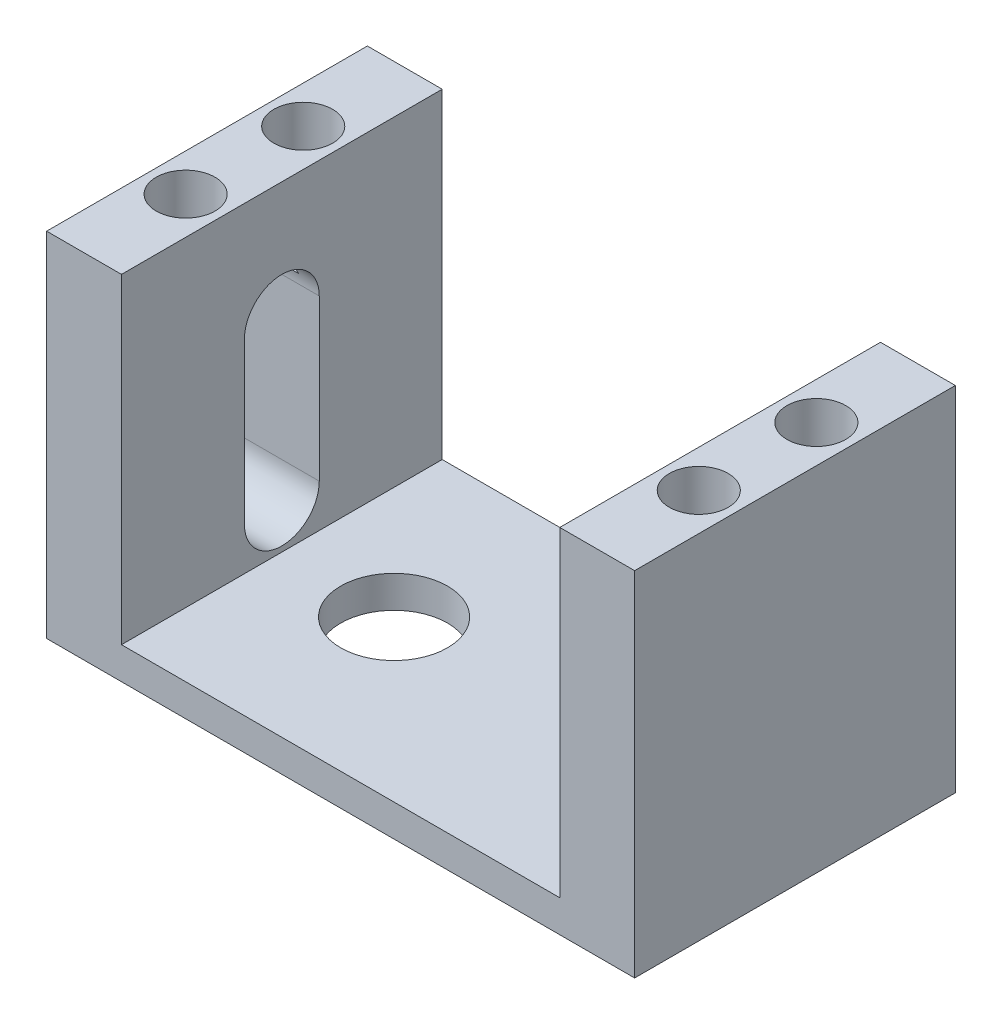
ISO-10303-21;
HEADER;
FILE_DESCRIPTION(('STEP AP214'),'2;1');
FILE_NAME('part.step','',(''),(''),'','','');
FILE_SCHEMA(('AUTOMOTIVE_DESIGN { 1 0 10303 214 1 1 1 1 }'));
ENDSEC;
DATA;
#1=APPLICATION_CONTEXT('core data for automotive mechanical design processes');
#2=APPLICATION_PROTOCOL_DEFINITION('international standard','automotive_design',2000,#1);
#3=PRODUCT_CONTEXT('',#1,'mechanical');
#4=PRODUCT('Part','Part','',(#3));
#5=PRODUCT_RELATED_PRODUCT_CATEGORY('part','',(#4));
#6=PRODUCT_DEFINITION_FORMATION('','',#4);
#7=PRODUCT_DEFINITION_CONTEXT('part definition',#1,'design');
#8=PRODUCT_DEFINITION('design','',#6,#7);
#9=PRODUCT_DEFINITION_SHAPE('','',#8);
#10=(LENGTH_UNIT() NAMED_UNIT(*) SI_UNIT(.MILLI.,.METRE.));
#11=(NAMED_UNIT(*) PLANE_ANGLE_UNIT() SI_UNIT($,.RADIAN.));
#12=(NAMED_UNIT(*) SI_UNIT($,.STERADIAN.) SOLID_ANGLE_UNIT());
#13=UNCERTAINTY_MEASURE_WITH_UNIT(LENGTH_MEASURE(1.E-05),#10,'distance_accuracy_value','');
#14=(GEOMETRIC_REPRESENTATION_CONTEXT(3) GLOBAL_UNCERTAINTY_ASSIGNED_CONTEXT((#13)) GLOBAL_UNIT_ASSIGNED_CONTEXT((#10,
#11,#12)) REPRESENTATION_CONTEXT('',''));
#15=CARTESIAN_POINT('',(0.,0.,0.));
#16=DIRECTION('',(0.,0.,1.));
#17=DIRECTION('',(1.,0.,0.));
#18=AXIS2_PLACEMENT_3D('',#15,#16,#17);
#19=CARTESIAN_POINT('',(0.,3.,0.));
#20=DIRECTION('',(0.,1.,0.));
#21=DIRECTION('',(0.,0.,1.));
#22=AXIS2_PLACEMENT_3D('',#19,#20,#21);
#23=PLANE('',#22);
#24=CARTESIAN_POINT('',(-10.,3.,0.));
#25=DIRECTION('',(0.,1.,0.));
#26=DIRECTION('',(0.,0.,1.));
#27=AXIS2_PLACEMENT_3D('',#24,#25,#26);
#28=CIRCLE('',#27,5.);
#29=CARTESIAN_POINT('',(-10.,3.,5.));
#30=VERTEX_POINT('',#29);
#31=EDGE_CURVE('E505',#30,#30,#28,.F.);
#32=ORIENTED_EDGE('',*,*,#31,.T.);
#33=EDGE_LOOP('',(#32));
#34=FACE_BOUND('',#33,.T.);
#35=DIRECTION('',(-1.,0.,0.));
#36=VECTOR('',#35,1.);
#37=CARTESIAN_POINT('',(-27.5,3.,-15.));
#38=LINE('',#37,#36);
#39=CARTESIAN_POINT('',(20.5,3.,-15.));
#40=VERTEX_POINT('',#39);
#41=CARTESIAN_POINT('',(-20.5,3.,-15.));
#42=VERTEX_POINT('',#41);
#43=EDGE_CURVE('E231',#40,#42,#38,.T.);
#44=ORIENTED_EDGE('',*,*,#43,.T.);
#45=DIRECTION('',(0.,0.,-1.));
#46=VECTOR('',#45,1.);
#47=CARTESIAN_POINT('',(-20.5,3.,-15.));
#48=LINE('',#47,#46);
#49=CARTESIAN_POINT('',(-20.5,3.,15.));
#50=VERTEX_POINT('',#49);
#51=EDGE_CURVE('E193',#50,#42,#48,.T.);
#52=ORIENTED_EDGE('',*,*,#51,.F.);
#53=DIRECTION('',(1.,0.,0.));
#54=VECTOR('',#53,1.);
#55=CARTESIAN_POINT('',(-27.5,3.,15.));
#56=LINE('',#55,#54);
#57=CARTESIAN_POINT('',(20.5,3.,15.));
#58=VERTEX_POINT('',#57);
#59=EDGE_CURVE('E39',#50,#58,#56,.T.);
#60=ORIENTED_EDGE('',*,*,#59,.T.);
#61=DIRECTION('',(0.,0.,1.));
#62=VECTOR('',#61,1.);
#63=CARTESIAN_POINT('',(20.5,3.,-15.));
#64=LINE('',#63,#62);
#65=EDGE_CURVE('E212',#40,#58,#64,.T.);
#66=ORIENTED_EDGE('',*,*,#65,.F.);
#67=EDGE_LOOP('',(#44,#52,#60,#66));
#68=FACE_BOUND('',#67,.T.);
#69=ADVANCED_FACE('F35',(#34,#68),#23,.T.);
#70=CARTESIAN_POINT('',(27.5,3.,-15.));
#71=DIRECTION('',(-1.,0.,0.));
#72=DIRECTION('',(0.,0.,1.));
#73=AXIS2_PLACEMENT_3D('',#70,#71,#72);
#74=PLANE('',#73);
#75=DIRECTION('',(0.,0.,-1.));
#76=VECTOR('',#75,1.);
#77=CARTESIAN_POINT('',(27.5,0.,-15.));
#78=LINE('',#77,#76);
#79=CARTESIAN_POINT('',(27.5,0.,15.));
#80=VERTEX_POINT('',#79);
#81=CARTESIAN_POINT('',(27.5,0.,-15.));
#82=VERTEX_POINT('',#81);
#83=EDGE_CURVE('E238',#80,#82,#78,.T.);
#84=ORIENTED_EDGE('',*,*,#83,.T.);
#85=DIRECTION('',(0.,-1.,0.));
#86=VECTOR('',#85,1.);
#87=CARTESIAN_POINT('',(27.5,3.,-15.));
#88=LINE('',#87,#86);
#89=CARTESIAN_POINT('',(27.5,33.,-15.));
#90=VERTEX_POINT('',#89);
#91=EDGE_CURVE('E11',#90,#82,#88,.T.);
#92=ORIENTED_EDGE('',*,*,#91,.F.);
#93=DIRECTION('',(0.,0.,-1.));
#94=VECTOR('',#93,1.);
#95=CARTESIAN_POINT('',(27.5,33.,15.));
#96=LINE('',#95,#94);
#97=CARTESIAN_POINT('',(27.5,33.,15.));
#98=VERTEX_POINT('',#97);
#99=EDGE_CURVE('E213',#98,#90,#96,.T.);
#100=ORIENTED_EDGE('',*,*,#99,.F.);
#101=DIRECTION('',(0.,-1.,0.));
#102=VECTOR('',#101,1.);
#103=CARTESIAN_POINT('',(27.5,3.,15.));
#104=LINE('',#103,#102);
#105=EDGE_CURVE('E256',#98,#80,#104,.T.);
#106=ORIENTED_EDGE('',*,*,#105,.T.);
#107=EDGE_LOOP('',(#84,#92,#100,#106));
#108=FACE_BOUND('',#107,.T.);
#109=ADVANCED_FACE('F37',(#108),#74,.F.);
#110=CARTESIAN_POINT('',(-27.5,3.,-15.));
#111=DIRECTION('',(0.,0.,1.));
#112=DIRECTION('',(1.,0.,0.));
#113=AXIS2_PLACEMENT_3D('',#110,#111,#112);
#114=PLANE('',#113);
#115=DIRECTION('',(-1.,0.,0.));
#116=VECTOR('',#115,1.);
#117=CARTESIAN_POINT('',(-27.5,0.,-15.));
#118=LINE('',#117,#116);
#119=CARTESIAN_POINT('',(-27.5,0.,-15.));
#120=VERTEX_POINT('',#119);
#121=EDGE_CURVE('E244',#82,#120,#118,.T.);
#122=ORIENTED_EDGE('',*,*,#121,.T.);
#123=DIRECTION('',(0.,-1.,0.));
#124=VECTOR('',#123,1.);
#125=CARTESIAN_POINT('',(-27.5,3.,-15.));
#126=LINE('',#125,#124);
#127=CARTESIAN_POINT('',(-27.5,33.,-15.));
#128=VERTEX_POINT('',#127);
#129=EDGE_CURVE('E45',#128,#120,#126,.T.);
#130=ORIENTED_EDGE('',*,*,#129,.F.);
#131=DIRECTION('',(-1.,0.,0.));
#132=VECTOR('',#131,1.);
#133=CARTESIAN_POINT('',(-20.5,33.,-15.));
#134=LINE('',#133,#132);
#135=CARTESIAN_POINT('',(-20.5,33.,-15.));
#136=VERTEX_POINT('',#135);
#137=EDGE_CURVE('E196',#136,#128,#134,.T.);
#138=ORIENTED_EDGE('',*,*,#137,.F.);
#139=DIRECTION('',(0.,-1.,0.));
#140=VECTOR('',#139,1.);
#141=CARTESIAN_POINT('',(-20.5,33.,-15.));
#142=LINE('',#141,#140);
#143=EDGE_CURVE('E206',#136,#42,#142,.T.);
#144=ORIENTED_EDGE('',*,*,#143,.T.);
#145=ORIENTED_EDGE('',*,*,#43,.F.);
#146=DIRECTION('',(0.,-1.,0.));
#147=VECTOR('',#146,1.);
#148=CARTESIAN_POINT('',(20.5,33.,-15.));
#149=LINE('',#148,#147);
#150=CARTESIAN_POINT('',(20.5,33.,-15.));
#151=VERTEX_POINT('',#150);
#152=EDGE_CURVE('E234',#151,#40,#149,.T.);
#153=ORIENTED_EDGE('',*,*,#152,.F.);
#154=DIRECTION('',(-1.,0.,0.));
#155=VECTOR('',#154,1.);
#156=CARTESIAN_POINT('',(27.5,33.,-15.));
#157=LINE('',#156,#155);
#158=EDGE_CURVE('E216',#90,#151,#157,.T.);
#159=ORIENTED_EDGE('',*,*,#158,.F.);
#160=ORIENTED_EDGE('',*,*,#91,.T.);
#161=EDGE_LOOP('',(#122,#130,#138,#144,#145,#153,#159,#160));
#162=FACE_BOUND('',#161,.T.);
#163=ADVANCED_FACE('F287',(#162),#114,.F.);
#164=CARTESIAN_POINT('',(-27.5,3.,-15.));
#165=DIRECTION('',(1.,0.,0.));
#166=DIRECTION('',(0.,0.,-1.));
#167=AXIS2_PLACEMENT_3D('',#164,#165,#166);
#168=PLANE('',#167);
#169=CARTESIAN_POINT('',(-27.5,7.,0.));
#170=DIRECTION('',(-1.,0.,0.));
#171=DIRECTION('',(0.,0.,1.));
#172=AXIS2_PLACEMENT_3D('',#169,#170,#171);
#173=CIRCLE('',#172,3.5);
#174=CARTESIAN_POINT('',(-27.5,7.,-3.49999999999999));
#175=VERTEX_POINT('',#174);
#176=CARTESIAN_POINT('',(-27.5,7.,3.5));
#177=VERTEX_POINT('',#176);
#178=EDGE_CURVE('E519',#175,#177,#173,.T.);
#179=ORIENTED_EDGE('',*,*,#178,.F.);
#180=DIRECTION('',(0.,-1.,0.));
#181=VECTOR('',#180,1.);
#182=CARTESIAN_POINT('',(-27.5,22.,-3.5));
#183=LINE('',#182,#181);
#184=CARTESIAN_POINT('',(-27.5,22.,-3.5));
#185=VERTEX_POINT('',#184);
#186=EDGE_CURVE('E522',#185,#175,#183,.T.);
#187=ORIENTED_EDGE('',*,*,#186,.F.);
#188=CARTESIAN_POINT('',(-27.5,22.,0.));
#189=DIRECTION('',(-1.,0.,0.));
#190=DIRECTION('',(0.,0.,1.));
#191=AXIS2_PLACEMENT_3D('',#188,#189,#190);
#192=CIRCLE('',#191,3.5);
#193=CARTESIAN_POINT('',(-27.5,22.,3.5));
#194=VERTEX_POINT('',#193);
#195=EDGE_CURVE('E160',#194,#185,#192,.T.);
#196=ORIENTED_EDGE('',*,*,#195,.F.);
#197=DIRECTION('',(0.,1.,0.));
#198=VECTOR('',#197,1.);
#199=CARTESIAN_POINT('',(-27.5,22.,3.5));
#200=LINE('',#199,#198);
#201=EDGE_CURVE('E53',#177,#194,#200,.T.);
#202=ORIENTED_EDGE('',*,*,#201,.F.);
#203=EDGE_LOOP('',(#179,#187,#196,#202));
#204=FACE_BOUND('',#203,.T.);
#205=DIRECTION('',(0.,0.,1.));
#206=VECTOR('',#205,1.);
#207=CARTESIAN_POINT('',(-27.5,0.,-15.));
#208=LINE('',#207,#206);
#209=CARTESIAN_POINT('',(-27.5,0.,15.));
#210=VERTEX_POINT('',#209);
#211=EDGE_CURVE('E249',#120,#210,#208,.T.);
#212=ORIENTED_EDGE('',*,*,#211,.T.);
#213=DIRECTION('',(0.,-1.,0.));
#214=VECTOR('',#213,1.);
#215=CARTESIAN_POINT('',(-27.5,3.,15.));
#216=LINE('',#215,#214);
#217=CARTESIAN_POINT('',(-27.5,33.,15.));
#218=VERTEX_POINT('',#217);
#219=EDGE_CURVE('E258',#218,#210,#216,.T.);
#220=ORIENTED_EDGE('',*,*,#219,.F.);
#221=DIRECTION('',(0.,0.,1.));
#222=VECTOR('',#221,1.);
#223=CARTESIAN_POINT('',(-27.5,33.,-15.));
#224=LINE('',#223,#222);
#225=EDGE_CURVE('E199',#128,#218,#224,.T.);
#226=ORIENTED_EDGE('',*,*,#225,.F.);
#227=ORIENTED_EDGE('',*,*,#129,.T.);
#228=EDGE_LOOP('',(#212,#220,#226,#227));
#229=FACE_BOUND('',#228,.T.);
#230=ADVANCED_FACE('F265',(#204,#229),#168,.F.);
#231=CARTESIAN_POINT('',(-27.5,3.,15.));
#232=DIRECTION('',(0.,0.,-1.));
#233=DIRECTION('',(-1.,0.,0.));
#234=AXIS2_PLACEMENT_3D('',#231,#232,#233);
#235=PLANE('',#234);
#236=DIRECTION('',(1.,0.,0.));
#237=VECTOR('',#236,1.);
#238=CARTESIAN_POINT('',(-27.5,0.,15.));
#239=LINE('',#238,#237);
#240=EDGE_CURVE('E254',#210,#80,#239,.T.);
#241=ORIENTED_EDGE('',*,*,#240,.T.);
#242=ORIENTED_EDGE('',*,*,#105,.F.);
#243=DIRECTION('',(1.,0.,0.));
#244=VECTOR('',#243,1.);
#245=CARTESIAN_POINT('',(20.5,33.,15.));
#246=LINE('',#245,#244);
#247=CARTESIAN_POINT('',(20.5,33.,15.));
#248=VERTEX_POINT('',#247);
#249=EDGE_CURVE('E220',#248,#98,#246,.T.);
#250=ORIENTED_EDGE('',*,*,#249,.F.);
#251=DIRECTION('',(0.,-1.,0.));
#252=VECTOR('',#251,1.);
#253=CARTESIAN_POINT('',(20.5,33.,15.));
#254=LINE('',#253,#252);
#255=EDGE_CURVE('E223',#248,#58,#254,.T.);
#256=ORIENTED_EDGE('',*,*,#255,.T.);
#257=ORIENTED_EDGE('',*,*,#59,.F.);
#258=DIRECTION('',(0.,-1.,0.));
#259=VECTOR('',#258,1.);
#260=CARTESIAN_POINT('',(-20.5,33.,15.));
#261=LINE('',#260,#259);
#262=CARTESIAN_POINT('',(-20.5,33.,15.));
#263=VERTEX_POINT('',#262);
#264=EDGE_CURVE('E210',#263,#50,#261,.T.);
#265=ORIENTED_EDGE('',*,*,#264,.F.);
#266=DIRECTION('',(1.,0.,0.));
#267=VECTOR('',#266,1.);
#268=CARTESIAN_POINT('',(-27.5,33.,15.));
#269=LINE('',#268,#267);
#270=EDGE_CURVE('E202',#218,#263,#269,.T.);
#271=ORIENTED_EDGE('',*,*,#270,.F.);
#272=ORIENTED_EDGE('',*,*,#219,.T.);
#273=EDGE_LOOP('',(#241,#242,#250,#256,#257,#265,#271,#272));
#274=FACE_BOUND('',#273,.T.);
#275=ADVANCED_FACE('F272',(#274),#235,.F.);
#276=CARTESIAN_POINT('',(0.,0.,0.));
#277=DIRECTION('',(0.,1.,0.));
#278=DIRECTION('',(0.,0.,1.));
#279=AXIS2_PLACEMENT_3D('',#276,#277,#278);
#280=PLANE('',#279);
#281=CARTESIAN_POINT('',(-10.,0.,0.));
#282=DIRECTION('',(0.,-1.,0.));
#283=DIRECTION('',(0.,0.,-1.));
#284=AXIS2_PLACEMENT_3D('',#281,#282,#283);
#285=CIRCLE('',#284,5.);
#286=CARTESIAN_POINT('',(-10.,0.,-5.));
#287=VERTEX_POINT('',#286);
#288=EDGE_CURVE('E517',#287,#287,#285,.T.);
#289=ORIENTED_EDGE('',*,*,#288,.F.);
#290=EDGE_LOOP('',(#289));
#291=FACE_BOUND('',#290,.T.);
#292=ORIENTED_EDGE('',*,*,#83,.F.);
#293=ORIENTED_EDGE('',*,*,#240,.F.);
#294=ORIENTED_EDGE('',*,*,#211,.F.);
#295=ORIENTED_EDGE('',*,*,#121,.F.);
#296=EDGE_LOOP('',(#292,#293,#294,#295));
#297=FACE_BOUND('',#296,.T.);
#298=ADVANCED_FACE('F270',(#291,#297),#280,.F.);
#299=CARTESIAN_POINT('',(20.5,33.,-15.));
#300=DIRECTION('',(1.,0.,0.));
#301=DIRECTION('',(0.,0.,-1.));
#302=AXIS2_PLACEMENT_3D('',#299,#300,#301);
#303=PLANE('',#302);
#304=ORIENTED_EDGE('',*,*,#65,.T.);
#305=ORIENTED_EDGE('',*,*,#255,.F.);
#306=DIRECTION('',(0.,0.,1.));
#307=VECTOR('',#306,1.);
#308=CARTESIAN_POINT('',(20.5,33.,-15.));
#309=LINE('',#308,#307);
#310=EDGE_CURVE('E218',#151,#248,#309,.T.);
#311=ORIENTED_EDGE('',*,*,#310,.F.);
#312=ORIENTED_EDGE('',*,*,#152,.T.);
#313=EDGE_LOOP('',(#304,#305,#311,#312));
#314=FACE_BOUND('',#313,.T.);
#315=ADVANCED_FACE('F282',(#314),#303,.F.);
#316=CARTESIAN_POINT('',(0.,33.,0.));
#317=DIRECTION('',(0.,1.,0.));
#318=DIRECTION('',(0.,0.,1.));
#319=AXIS2_PLACEMENT_3D('',#316,#317,#318);
#320=PLANE('',#319);
#321=CARTESIAN_POINT('',(24.,33.,-5.50000000000001));
#322=DIRECTION('',(0.,1.,0.));
#323=DIRECTION('',(0.,0.,-1.));
#324=AXIS2_PLACEMENT_3D('',#321,#322,#323);
#325=CIRCLE('',#324,2.75);
#326=CARTESIAN_POINT('',(24.,33.,-8.25));
#327=VERTEX_POINT('',#326);
#328=EDGE_CURVE('E174',#327,#327,#325,.T.);
#329=ORIENTED_EDGE('',*,*,#328,.F.);
#330=EDGE_LOOP('',(#329));
#331=FACE_BOUND('',#330,.T.);
#332=CARTESIAN_POINT('',(24.,33.,5.49999999999999));
#333=DIRECTION('',(0.,1.,0.));
#334=DIRECTION('',(0.,0.,-1.));
#335=AXIS2_PLACEMENT_3D('',#332,#333,#334);
#336=CIRCLE('',#335,2.75);
#337=CARTESIAN_POINT('',(24.,33.,2.75));
#338=VERTEX_POINT('',#337);
#339=EDGE_CURVE('E173',#338,#338,#336,.T.);
#340=ORIENTED_EDGE('',*,*,#339,.F.);
#341=EDGE_LOOP('',(#340));
#342=FACE_BOUND('',#341,.T.);
#343=ORIENTED_EDGE('',*,*,#99,.T.);
#344=ORIENTED_EDGE('',*,*,#158,.T.);
#345=ORIENTED_EDGE('',*,*,#310,.T.);
#346=ORIENTED_EDGE('',*,*,#249,.T.);
#347=EDGE_LOOP('',(#343,#344,#345,#346));
#348=FACE_BOUND('',#347,.T.);
#349=ADVANCED_FACE('F278',(#331,#342,#348),#320,.T.);
#350=CARTESIAN_POINT('',(-20.5,33.,-15.));
#351=DIRECTION('',(-1.,0.,0.));
#352=DIRECTION('',(0.,0.,1.));
#353=AXIS2_PLACEMENT_3D('',#350,#351,#352);
#354=PLANE('',#353);
#355=CARTESIAN_POINT('',(-20.5,22.,0.));
#356=DIRECTION('',(-1.,0.,0.));
#357=DIRECTION('',(0.,0.,1.));
#358=AXIS2_PLACEMENT_3D('',#355,#356,#357);
#359=CIRCLE('',#358,3.5);
#360=CARTESIAN_POINT('',(-20.5,22.,-3.5));
#361=VERTEX_POINT('',#360);
#362=CARTESIAN_POINT('',(-20.5,22.,3.5));
#363=VERTEX_POINT('',#362);
#364=EDGE_CURVE('E150',#361,#363,#359,.F.);
#365=ORIENTED_EDGE('',*,*,#364,.F.);
#366=DIRECTION('',(0.,1.,0.));
#367=VECTOR('',#366,1.);
#368=CARTESIAN_POINT('',(-20.5,22.,-3.5));
#369=LINE('',#368,#367);
#370=CARTESIAN_POINT('',(-20.5,7.,-3.5));
#371=VERTEX_POINT('',#370);
#372=EDGE_CURVE('E61',#371,#361,#369,.T.);
#373=ORIENTED_EDGE('',*,*,#372,.F.);
#374=CARTESIAN_POINT('',(-20.5,7.,0.));
#375=DIRECTION('',(-1.,0.,0.));
#376=DIRECTION('',(0.,0.,1.));
#377=AXIS2_PLACEMENT_3D('',#374,#375,#376);
#378=CIRCLE('',#377,3.5);
#379=CARTESIAN_POINT('',(-20.5,7.,3.5));
#380=VERTEX_POINT('',#379);
#381=EDGE_CURVE('E158',#380,#371,#378,.F.);
#382=ORIENTED_EDGE('',*,*,#381,.F.);
#383=DIRECTION('',(0.,-1.,0.));
#384=VECTOR('',#383,1.);
#385=CARTESIAN_POINT('',(-20.5,22.,3.5));
#386=LINE('',#385,#384);
#387=EDGE_CURVE('E141',#363,#380,#386,.T.);
#388=ORIENTED_EDGE('',*,*,#387,.F.);
#389=EDGE_LOOP('',(#365,#373,#382,#388));
#390=FACE_BOUND('',#389,.T.);
#391=ORIENTED_EDGE('',*,*,#51,.T.);
#392=ORIENTED_EDGE('',*,*,#143,.F.);
#393=DIRECTION('',(0.,0.,-1.));
#394=VECTOR('',#393,1.);
#395=CARTESIAN_POINT('',(-20.5,33.,-15.));
#396=LINE('',#395,#394);
#397=EDGE_CURVE('E204',#263,#136,#396,.T.);
#398=ORIENTED_EDGE('',*,*,#397,.F.);
#399=ORIENTED_EDGE('',*,*,#264,.T.);
#400=EDGE_LOOP('',(#391,#392,#398,#399));
#401=FACE_BOUND('',#400,.T.);
#402=ADVANCED_FACE('F155',(#390,#401),#354,.F.);
#403=CARTESIAN_POINT('',(0.,33.,0.));
#404=DIRECTION('',(0.,1.,0.));
#405=DIRECTION('',(0.,0.,1.));
#406=AXIS2_PLACEMENT_3D('',#403,#404,#405);
#407=PLANE('',#406);
#408=CARTESIAN_POINT('',(-24.,33.,5.5));
#409=DIRECTION('',(0.,1.,0.));
#410=DIRECTION('',(0.,0.,1.));
#411=AXIS2_PLACEMENT_3D('',#408,#409,#410);
#412=CIRCLE('',#411,2.75);
#413=CARTESIAN_POINT('',(-24.,33.,8.25));
#414=VERTEX_POINT('',#413);
#415=EDGE_CURVE('E181',#414,#414,#412,.T.);
#416=ORIENTED_EDGE('',*,*,#415,.F.);
#417=EDGE_LOOP('',(#416));
#418=FACE_BOUND('',#417,.T.);
#419=CARTESIAN_POINT('',(-24.,33.,-5.5));
#420=DIRECTION('',(0.,1.,0.));
#421=DIRECTION('',(0.,0.,1.));
#422=AXIS2_PLACEMENT_3D('',#419,#420,#421);
#423=CIRCLE('',#422,2.75);
#424=CARTESIAN_POINT('',(-24.,33.,-2.75));
#425=VERTEX_POINT('',#424);
#426=EDGE_CURVE('E187',#425,#425,#423,.T.);
#427=ORIENTED_EDGE('',*,*,#426,.F.);
#428=EDGE_LOOP('',(#427));
#429=FACE_BOUND('',#428,.T.);
#430=ORIENTED_EDGE('',*,*,#137,.T.);
#431=ORIENTED_EDGE('',*,*,#225,.T.);
#432=ORIENTED_EDGE('',*,*,#270,.T.);
#433=ORIENTED_EDGE('',*,*,#397,.T.);
#434=EDGE_LOOP('',(#430,#431,#432,#433));
#435=FACE_BOUND('',#434,.T.);
#436=ADVANCED_FACE('F291',(#418,#429,#435),#407,.T.);
#437=CARTESIAN_POINT('',(-24.,23.,-5.5));
#438=DIRECTION('',(0.,1.,0.));
#439=DIRECTION('',(0.,0.,1.));
#440=AXIS2_PLACEMENT_3D('',#437,#438,#439);
#441=CYLINDRICAL_SURFACE('',#440,2.75);
#442=CARTESIAN_POINT('',(-24.,23.,-5.5));
#443=DIRECTION('',(0.,1.,0.));
#444=DIRECTION('',(0.,0.,1.));
#445=AXIS2_PLACEMENT_3D('',#442,#443,#444);
#446=CIRCLE('',#445,2.75);
#447=CARTESIAN_POINT('',(-22.2802262855984,23.,-3.35410196624968));
#448=VERTEX_POINT('',#447);
#449=CARTESIAN_POINT('',(-25.7197737144016,23.,-3.35410196624968));
#450=VERTEX_POINT('',#449);
#451=EDGE_CURVE('E190',#448,#450,#446,.T.);
#452=ORIENTED_EDGE('',*,*,#451,.F.);
#453=CARTESIAN_POINT('',(-25.7197737144016,23.,-3.35410196624968));
#454=CARTESIAN_POINT('',(-25.7017861807159,23.0483574767552,-3.33969373809158));
#455=CARTESIAN_POINT('',(-25.6822245740191,23.0958691014806,-3.32438083990102));
#456=CARTESIAN_POINT('',(-25.6398312595873,23.1889123552969,-3.29224773358903));
#457=CARTESIAN_POINT('',(-25.6169978415567,23.2344429324917,-3.27542673886246));
#458=CARTESIAN_POINT('',(-25.5678832246716,23.3233189700396,-3.24054242047114));
#459=CARTESIAN_POINT('',(-25.5415917792581,23.3666573844756,-3.22247548373751));
#460=CARTESIAN_POINT('',(-25.4855709586734,23.4506617787203,-3.18554392409529));
#461=CARTESIAN_POINT('',(-25.4558422027834,23.4913282378563,-3.16667944526275));
#462=CARTESIAN_POINT('',(-25.3611781441435,23.6091802549706,-3.10936503681371));
#463=CARTESIAN_POINT('',(-25.2909184533913,23.6819355386968,-3.07030877152763));
#464=CARTESIAN_POINT('',(-25.1372463719622,23.8131349378167,-2.99471243380997));
#465=CARTESIAN_POINT('',(-25.0538612974771,23.8716081457033,-2.95816735717018));
#466=CARTESIAN_POINT('',(-24.8807300584572,23.9703098488629,-2.89330044966885));
#467=CARTESIAN_POINT('',(-24.7915815109424,24.0113615026891,-2.86463810710713));
#468=CARTESIAN_POINT('',(-24.6057479137799,24.0791563703275,-2.81582521463158));
#469=CARTESIAN_POINT('',(-24.5090588174147,24.1058918398203,-2.79567927289054));
#470=CARTESIAN_POINT('',(-24.3165144694626,24.1438954340408,-2.76663227596203));
#471=CARTESIAN_POINT('',(-24.2208859795145,24.1559073629013,-2.75719245560625));
#472=CARTESIAN_POINT('',(-24.0284449671781,24.1670279986156,-2.74846189800399));
#473=CARTESIAN_POINT('',(-23.9316328029459,24.1661405165345,-2.74916816314757));
#474=CARTESIAN_POINT('',(-23.7404015703283,24.1515264052347,-2.76061880331371));
#475=CARTESIAN_POINT('',(-23.6459692943872,24.1379066356358,-2.7712796307602));
#476=CARTESIAN_POINT('',(-23.4613486367304,24.0979500640918,-2.80164761093278));
#477=CARTESIAN_POINT('',(-23.3711601214001,24.0716136628234,-2.82135447863446));
#478=CARTESIAN_POINT('',(-23.1974090033171,24.0062725873437,-2.86818361368007));
#479=CARTESIAN_POINT('',(-23.1138556639971,23.9672505765021,-2.89531602097428));
#480=CARTESIAN_POINT('',(-22.9556468970495,23.8770012374922,-2.95461799544054));
#481=CARTESIAN_POINT('',(-22.8809896243856,23.8257764468024,-2.98678651491383));
#482=CARTESIAN_POINT('',(-22.7405600215805,23.7108743867671,-3.05408281716615));
#483=CARTESIAN_POINT('',(-22.6750064837338,23.6469588189365,-3.08925846230325));
#484=CARTESIAN_POINT('',(-22.5553300106214,23.5088542779038,-3.15900879231877));
#485=CARTESIAN_POINT('',(-22.5012152727112,23.4346579998775,-3.19358303003867));
#486=CARTESIAN_POINT('',(-22.4183931898711,23.3005910325465,-3.24994172279825));
#487=CARTESIAN_POINT('',(-22.3868608990537,23.2427678040302,-3.27253711406551));
#488=CARTESIAN_POINT('',(-22.3294267923658,23.1237655345345,-3.31529407416746));
#489=CARTESIAN_POINT('',(-22.3035085037758,23.0625969896418,-3.33546268412089));
#490=CARTESIAN_POINT('',(-22.2802262855984,23.,-3.35410196624968));
#491=B_SPLINE_CURVE_WITH_KNOTS('',3,(#453,#454,#455,#456,#457,#458,#459,#460,#461,#462,#463,
#464,#465,#466,#467,#468,#469,#470,#471,#472,#473,#474,#475,#476,#477,#478,#479,#480,#481,#482,
#483,#484,#485,#486,#487,#488,#489,#490),.UNSPECIFIED.,.F.,.F.,(4,2,2,2,2,2,2,2,2,2,2,2,2,2,2,2,
2,2,4),(0.,0.160680386209557,0.32144507445736,0.48269733705506,0.643920592860245,
0.967379157361524,1.29017323867257,1.59530694510956,1.90060554686315,2.18974422827673,
2.47879748687786,2.76544635122677,3.05208618440682,3.3391194088426,3.62609299884227,
3.91907594980752,4.212268153809,4.42082430446127,4.62875995699674),.UNSPECIFIED.);
#492=EDGE_CURVE('E177',#450,#448,#491,.T.);
#493=ORIENTED_EDGE('',*,*,#492,.F.);
#494=EDGE_LOOP('',(#452,#493));
#495=FACE_BOUND('',#494,.T.);
#496=ORIENTED_EDGE('',*,*,#426,.T.);
#497=EDGE_LOOP('',(#496));
#498=FACE_BOUND('',#497,.T.);
#499=ADVANCED_FACE('F293',(#495,#498),#441,.F.);
#500=CARTESIAN_POINT('',(-24.,23.,-5.5));
#501=DIRECTION('',(0.,1.,0.));
#502=DIRECTION('',(0.,0.,1.));
#503=AXIS2_PLACEMENT_3D('',#500,#501,#502);
#504=PLANE('',#503);
#505=DIRECTION('',(-1.,0.,0.));
#506=VECTOR('',#505,1.);
#507=CARTESIAN_POINT('',(27.501,23.,-3.35410196624969));
#508=LINE('',#507,#506);
#509=EDGE_CURVE('E146',#450,#448,#508,.F.);
#510=ORIENTED_EDGE('',*,*,#509,.T.);
#511=ORIENTED_EDGE('',*,*,#451,.T.);
#512=EDGE_LOOP('',(#510,#511));
#513=FACE_BOUND('',#512,.T.);
#514=ADVANCED_FACE('F300',(#513),#504,.T.);
#515=CARTESIAN_POINT('',(-24.,23.,5.5));
#516=DIRECTION('',(0.,1.,0.));
#517=DIRECTION('',(0.,0.,1.));
#518=AXIS2_PLACEMENT_3D('',#515,#516,#517);
#519=CYLINDRICAL_SURFACE('',#518,2.75);
#520=CARTESIAN_POINT('',(-24.,23.,5.5));
#521=DIRECTION('',(0.,1.,0.));
#522=DIRECTION('',(0.,0.,1.));
#523=AXIS2_PLACEMENT_3D('',#520,#521,#522);
#524=CIRCLE('',#523,2.75);
#525=CARTESIAN_POINT('',(-25.7197737144016,23.,3.35410196624969));
#526=VERTEX_POINT('',#525);
#527=CARTESIAN_POINT('',(-22.2802262855984,23.,3.35410196624969));
#528=VERTEX_POINT('',#527);
#529=EDGE_CURVE('E184',#526,#528,#524,.T.);
#530=ORIENTED_EDGE('',*,*,#529,.F.);
#531=CARTESIAN_POINT('',(-22.2802262855984,23.,3.35410196624969));
#532=CARTESIAN_POINT('',(-22.2982138192841,23.0483574767552,3.33969373809159));
#533=CARTESIAN_POINT('',(-22.3177754259809,23.0958691014806,3.32438083990103));
#534=CARTESIAN_POINT('',(-22.3601687404127,23.1889123552969,3.29224773358903));
#535=CARTESIAN_POINT('',(-22.3830021584433,23.2344429324917,3.27542673886247));
#536=CARTESIAN_POINT('',(-22.4321167753284,23.3233189700396,3.24054242047114));
#537=CARTESIAN_POINT('',(-22.4584082207419,23.3666573844756,3.22247548373751));
#538=CARTESIAN_POINT('',(-22.5144290413266,23.4506617787203,3.18554392409529));
#539=CARTESIAN_POINT('',(-22.5441577972166,23.4913282378563,3.16667944526275));
#540=CARTESIAN_POINT('',(-22.6388218558565,23.6091802549706,3.10936503681371));
#541=CARTESIAN_POINT('',(-22.7090815466087,23.6819355386968,3.07030877152763));
#542=CARTESIAN_POINT('',(-22.8627536280378,23.8131349378167,2.99471243380997));
#543=CARTESIAN_POINT('',(-22.9461387025229,23.8716081457033,2.95816735717018));
#544=CARTESIAN_POINT('',(-23.1192699415428,23.970309848863,2.89330044966885));
#545=CARTESIAN_POINT('',(-23.2084184890576,24.0113615026891,2.86463810710713));
#546=CARTESIAN_POINT('',(-23.3942520862201,24.0791563703275,2.81582521463158));
#547=CARTESIAN_POINT('',(-23.4909411825853,24.1058918398203,2.79567927289054));
#548=CARTESIAN_POINT('',(-23.6834855305374,24.1438954340408,2.76663227596203));
#549=CARTESIAN_POINT('',(-23.7791140204855,24.1559073629013,2.75719245560625));
#550=CARTESIAN_POINT('',(-23.9715550328219,24.1670279986156,2.74846189800399));
#551=CARTESIAN_POINT('',(-24.0683671970541,24.1661405165345,2.74916816314757));
#552=CARTESIAN_POINT('',(-24.2595984296717,24.1515264052347,2.76061880331371));
#553=CARTESIAN_POINT('',(-24.3540307056128,24.1379066356358,2.7712796307602));
#554=CARTESIAN_POINT('',(-24.5386513632696,24.0979500640918,2.80164761093278));
#555=CARTESIAN_POINT('',(-24.6288398785999,24.0716136628235,2.82135447863446));
#556=CARTESIAN_POINT('',(-24.8025909966829,24.0062725873437,2.86818361368007));
#557=CARTESIAN_POINT('',(-24.8861443360029,23.9672505765021,2.89531602097428));
#558=CARTESIAN_POINT('',(-25.0443531029505,23.8770012374922,2.95461799544054));
#559=CARTESIAN_POINT('',(-25.1190103756144,23.8257764468024,2.98678651491383));
#560=CARTESIAN_POINT('',(-25.2594399784195,23.7108743867671,3.05408281716616));
#561=CARTESIAN_POINT('',(-25.3249935162662,23.6469588189365,3.08925846230326));
#562=CARTESIAN_POINT('',(-25.4446699893786,23.5088542779038,3.15900879231878));
#563=CARTESIAN_POINT('',(-25.4987847272888,23.4346579998775,3.19358303003867));
#564=CARTESIAN_POINT('',(-25.5816068101289,23.3005910325465,3.24994172279825));
#565=CARTESIAN_POINT('',(-25.6131391009463,23.2427678040302,3.27253711406551));
#566=CARTESIAN_POINT('',(-25.6705732076342,23.1237655345345,3.31529407416746));
#567=CARTESIAN_POINT('',(-25.6964914962242,23.0625969896418,3.33546268412089));
#568=CARTESIAN_POINT('',(-25.7197737144016,23.,3.35410196624969));
#569=B_SPLINE_CURVE_WITH_KNOTS('',3,(#531,#532,#533,#534,#535,#536,#537,#538,#539,#540,#541,
#542,#543,#544,#545,#546,#547,#548,#549,#550,#551,#552,#553,#554,#555,#556,#557,#558,#559,#560,
#561,#562,#563,#564,#565,#566,#567,#568),.UNSPECIFIED.,.F.,.F.,(4,2,2,2,2,2,2,2,2,2,2,2,2,2,2,2,
2,2,4),(0.,0.160680386209557,0.321445074457359,0.482697337055061,0.643920592860249,
0.967379157361533,1.29017323867258,1.59530694510956,1.90060554686316,2.18974422827674,
2.47879748687787,2.76544635122678,3.05208618440683,3.33911940884261,3.62609299884228,
3.91907594980754,4.21226815380901,4.42082430446129,4.62875995699675),.UNSPECIFIED.);
#570=EDGE_CURVE('E168',#528,#526,#569,.T.);
#571=ORIENTED_EDGE('',*,*,#570,.F.);
#572=EDGE_LOOP('',(#530,#571));
#573=FACE_BOUND('',#572,.T.);
#574=ORIENTED_EDGE('',*,*,#415,.T.);
#575=EDGE_LOOP('',(#574));
#576=FACE_BOUND('',#575,.T.);
#577=ADVANCED_FACE('F374',(#573,#576),#519,.F.);
#578=CARTESIAN_POINT('',(-24.,23.,5.5));
#579=DIRECTION('',(0.,1.,0.));
#580=DIRECTION('',(0.,0.,1.));
#581=AXIS2_PLACEMENT_3D('',#578,#579,#580);
#582=PLANE('',#581);
#583=DIRECTION('',(-1.,0.,0.));
#584=VECTOR('',#583,1.);
#585=CARTESIAN_POINT('',(27.501,23.,3.35410196624967));
#586=LINE('',#585,#584);
#587=EDGE_CURVE('E169',#528,#526,#586,.T.);
#588=ORIENTED_EDGE('',*,*,#587,.T.);
#589=ORIENTED_EDGE('',*,*,#529,.T.);
#590=EDGE_LOOP('',(#588,#589));
#591=FACE_BOUND('',#590,.T.);
#592=ADVANCED_FACE('F384',(#591),#582,.T.);
#593=CARTESIAN_POINT('',(24.,23.,5.49999999999999));
#594=DIRECTION('',(0.,1.,0.));
#595=DIRECTION('',(0.,0.,1.));
#596=AXIS2_PLACEMENT_3D('',#593,#594,#595);
#597=CYLINDRICAL_SURFACE('',#596,2.75);
#598=CARTESIAN_POINT('',(24.,23.,5.49999999999999));
#599=DIRECTION('',(0.,1.,0.));
#600=DIRECTION('',(0.,0.,-1.));
#601=AXIS2_PLACEMENT_3D('',#598,#599,#600);
#602=CIRCLE('',#601,2.75);
#603=CARTESIAN_POINT('',(24.,23.,2.75));
#604=VERTEX_POINT('',#603);
#605=EDGE_CURVE('E178',#604,#604,#602,.T.);
#606=ORIENTED_EDGE('',*,*,#605,.F.);
#607=EDGE_LOOP('',(#606));
#608=FACE_BOUND('',#607,.T.);
#609=ORIENTED_EDGE('',*,*,#339,.T.);
#610=EDGE_LOOP('',(#609));
#611=FACE_BOUND('',#610,.T.);
#612=ADVANCED_FACE('F394',(#608,#611),#597,.F.);
#613=CARTESIAN_POINT('',(24.,23.,5.49999999999999));
#614=DIRECTION('',(0.,-1.,0.));
#615=DIRECTION('',(0.,0.,-1.));
#616=AXIS2_PLACEMENT_3D('',#613,#614,#615);
#617=PLANE('',#616);
#618=ORIENTED_EDGE('',*,*,#605,.T.);
#619=EDGE_LOOP('',(#618));
#620=FACE_BOUND('',#619,.T.);
#621=ADVANCED_FACE('F543',(#620),#617,.F.);
#622=CARTESIAN_POINT('',(24.,23.,-5.50000000000001));
#623=DIRECTION('',(0.,1.,0.));
#624=DIRECTION('',(0.,0.,1.));
#625=AXIS2_PLACEMENT_3D('',#622,#623,#624);
#626=CYLINDRICAL_SURFACE('',#625,2.75);
#627=CARTESIAN_POINT('',(24.,23.,-5.50000000000001));
#628=DIRECTION('',(0.,1.,0.));
#629=DIRECTION('',(0.,0.,-1.));
#630=AXIS2_PLACEMENT_3D('',#627,#628,#629);
#631=CIRCLE('',#630,2.75);
#632=CARTESIAN_POINT('',(24.,23.,-8.25));
#633=VERTEX_POINT('',#632);
#634=EDGE_CURVE('E170',#633,#633,#631,.T.);
#635=ORIENTED_EDGE('',*,*,#634,.F.);
#636=EDGE_LOOP('',(#635));
#637=FACE_BOUND('',#636,.T.);
#638=ORIENTED_EDGE('',*,*,#328,.T.);
#639=EDGE_LOOP('',(#638));
#640=FACE_BOUND('',#639,.T.);
#641=ADVANCED_FACE('F539',(#637,#640),#626,.F.);
#642=CARTESIAN_POINT('',(24.,23.,-5.50000000000001));
#643=DIRECTION('',(0.,-1.,0.));
#644=DIRECTION('',(0.,0.,-1.));
#645=AXIS2_PLACEMENT_3D('',#642,#643,#644);
#646=PLANE('',#645);
#647=ORIENTED_EDGE('',*,*,#634,.T.);
#648=EDGE_LOOP('',(#647));
#649=FACE_BOUND('',#648,.T.);
#650=ADVANCED_FACE('F408',(#649),#646,.F.);
#651=CARTESIAN_POINT('',(27.501,22.,-3.50000000000001));
#652=DIRECTION('',(0.,0.,-1.));
#653=DIRECTION('',(-1.,0.,0.));
#654=AXIS2_PLACEMENT_3D('',#651,#652,#653);
#655=PLANE('',#654);
#656=ORIENTED_EDGE('',*,*,#372,.T.);
#657=DIRECTION('',(-1.,0.,0.));
#658=VECTOR('',#657,1.);
#659=CARTESIAN_POINT('',(27.501,22.,-3.50000000000001));
#660=LINE('',#659,#658);
#661=EDGE_CURVE('E152',#361,#185,#660,.T.);
#662=ORIENTED_EDGE('',*,*,#661,.T.);
#663=ORIENTED_EDGE('',*,*,#186,.T.);
#664=DIRECTION('',(-1.,0.,0.));
#665=VECTOR('',#664,1.);
#666=CARTESIAN_POINT('',(27.501,7.,-3.50000000000001));
#667=LINE('',#666,#665);
#668=EDGE_CURVE('E165',#371,#175,#667,.T.);
#669=ORIENTED_EDGE('',*,*,#668,.F.);
#670=EDGE_LOOP('',(#656,#662,#663,#669));
#671=FACE_BOUND('',#670,.T.);
#672=ADVANCED_FACE('F402',(#671),#655,.F.);
#673=CARTESIAN_POINT('',(27.501,7.,0.));
#674=DIRECTION('',(-1.,0.,0.));
#675=DIRECTION('',(0.,0.,1.));
#676=AXIS2_PLACEMENT_3D('',#673,#674,#675);
#677=CYLINDRICAL_SURFACE('',#676,3.5);
#678=ORIENTED_EDGE('',*,*,#381,.T.);
#679=ORIENTED_EDGE('',*,*,#668,.T.);
#680=ORIENTED_EDGE('',*,*,#178,.T.);
#681=DIRECTION('',(-1.,0.,0.));
#682=VECTOR('',#681,1.);
#683=CARTESIAN_POINT('',(27.501,7.,3.49999999999999));
#684=LINE('',#683,#682);
#685=EDGE_CURVE('E147',#380,#177,#684,.T.);
#686=ORIENTED_EDGE('',*,*,#685,.F.);
#687=EDGE_LOOP('',(#678,#679,#680,#686));
#688=FACE_BOUND('',#687,.T.);
#689=ADVANCED_FACE('F407',(#688),#677,.F.);
#690=CARTESIAN_POINT('',(27.501,22.,3.49999999999999));
#691=DIRECTION('',(0.,0.,1.));
#692=DIRECTION('',(1.,0.,0.));
#693=AXIS2_PLACEMENT_3D('',#690,#691,#692);
#694=PLANE('',#693);
#695=ORIENTED_EDGE('',*,*,#387,.T.);
#696=ORIENTED_EDGE('',*,*,#685,.T.);
#697=ORIENTED_EDGE('',*,*,#201,.T.);
#698=DIRECTION('',(-1.,0.,0.));
#699=VECTOR('',#698,1.);
#700=CARTESIAN_POINT('',(27.501,22.,3.49999999999999));
#701=LINE('',#700,#699);
#702=EDGE_CURVE('E137',#363,#194,#701,.T.);
#703=ORIENTED_EDGE('',*,*,#702,.F.);
#704=EDGE_LOOP('',(#695,#696,#697,#703));
#705=FACE_BOUND('',#704,.T.);
#706=ADVANCED_FACE('F139',(#705),#694,.F.);
#707=CARTESIAN_POINT('',(27.501,22.,0.));
#708=DIRECTION('',(-1.,0.,0.));
#709=DIRECTION('',(0.,0.,1.));
#710=AXIS2_PLACEMENT_3D('',#707,#708,#709);
#711=CYLINDRICAL_SURFACE('',#710,3.5);
#712=ORIENTED_EDGE('',*,*,#492,.T.);
#713=ORIENTED_EDGE('',*,*,#509,.F.);
#714=EDGE_LOOP('',(#712,#713));
#715=FACE_BOUND('',#714,.T.);
#716=ORIENTED_EDGE('',*,*,#570,.T.);
#717=ORIENTED_EDGE('',*,*,#587,.F.);
#718=EDGE_LOOP('',(#716,#717));
#719=FACE_BOUND('',#718,.T.);
#720=ORIENTED_EDGE('',*,*,#364,.T.);
#721=ORIENTED_EDGE('',*,*,#702,.T.);
#722=ORIENTED_EDGE('',*,*,#195,.T.);
#723=ORIENTED_EDGE('',*,*,#661,.F.);
#724=EDGE_LOOP('',(#720,#721,#722,#723));
#725=FACE_BOUND('',#724,.T.);
#726=ADVANCED_FACE('F151',(#715,#719,#725),#711,.F.);
#727=CARTESIAN_POINT('',(-10.,33.001025,0.));
#728=DIRECTION('',(0.,-1.,0.));
#729=DIRECTION('',(0.,0.,-1.));
#730=AXIS2_PLACEMENT_3D('',#727,#728,#729);
#731=CYLINDRICAL_SURFACE('',#730,5.);
#732=ORIENTED_EDGE('',*,*,#31,.F.);
#733=EDGE_LOOP('',(#732));
#734=FACE_BOUND('',#733,.T.);
#735=ORIENTED_EDGE('',*,*,#288,.T.);
#736=EDGE_LOOP('',(#735));
#737=FACE_BOUND('',#736,.T.);
#738=ADVANCED_FACE('F435',(#734,#737),#731,.F.);
#739=CLOSED_SHELL('',(#69,#109,#163,#230,#275,#298,#315,#349,#402,#436,#499,#514,#577,#592,#612,
#621,#641,#650,#672,#689,#706,#726,#738));
#740=MANIFOLD_SOLID_BREP('B2',#739);
#741=ADVANCED_BREP_SHAPE_REPRESENTATION('',(#18,#740),#14);
#742=SHAPE_DEFINITION_REPRESENTATION(#9,#741);
ENDSEC;
END-ISO-10303-21;
